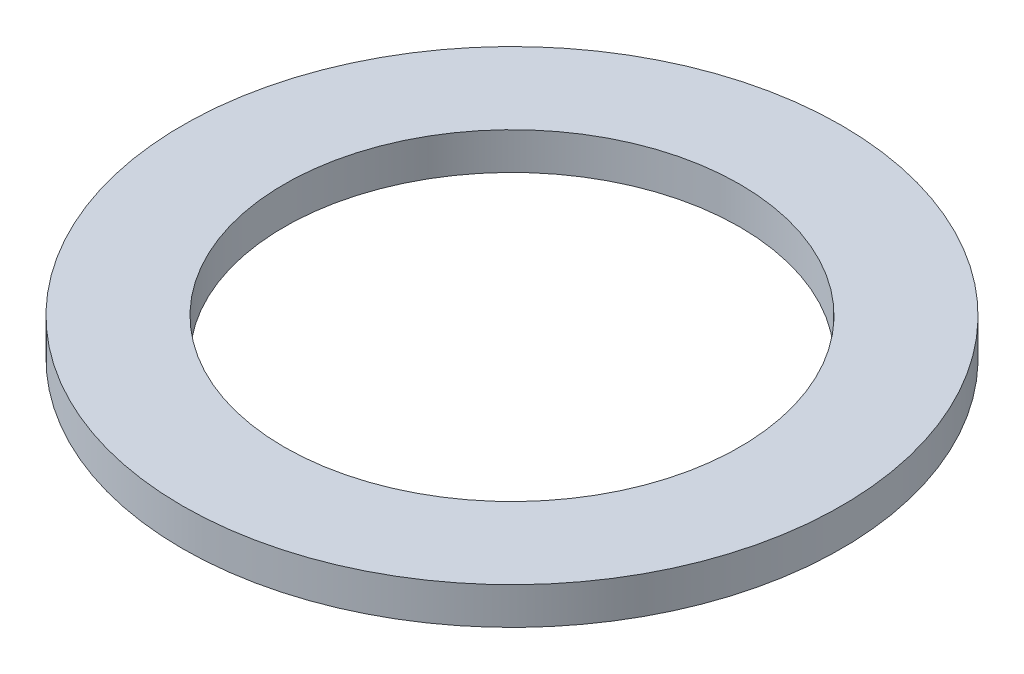
ISO-10303-21;
HEADER;
FILE_DESCRIPTION(('STEP AP214'),'2;1');
FILE_NAME('part.step','',(''),(''),'','','');
FILE_SCHEMA(('AUTOMOTIVE_DESIGN { 1 0 10303 214 1 1 1 1 }'));
ENDSEC;
DATA;
#1=APPLICATION_CONTEXT('core data for automotive mechanical design processes');
#2=APPLICATION_PROTOCOL_DEFINITION('international standard','automotive_design',2000,#1);
#3=PRODUCT_CONTEXT('',#1,'mechanical');
#4=PRODUCT('Part','Part','',(#3));
#5=PRODUCT_RELATED_PRODUCT_CATEGORY('part','',(#4));
#6=PRODUCT_DEFINITION_FORMATION('','',#4);
#7=PRODUCT_DEFINITION_CONTEXT('part definition',#1,'design');
#8=PRODUCT_DEFINITION('design','',#6,#7);
#9=PRODUCT_DEFINITION_SHAPE('','',#8);
#10=(LENGTH_UNIT() NAMED_UNIT(*) SI_UNIT(.MILLI.,.METRE.));
#11=(NAMED_UNIT(*) PLANE_ANGLE_UNIT() SI_UNIT($,.RADIAN.));
#12=(NAMED_UNIT(*) SI_UNIT($,.STERADIAN.) SOLID_ANGLE_UNIT());
#13=UNCERTAINTY_MEASURE_WITH_UNIT(LENGTH_MEASURE(1.E-05),#10,'distance_accuracy_value','');
#14=(GEOMETRIC_REPRESENTATION_CONTEXT(3) GLOBAL_UNCERTAINTY_ASSIGNED_CONTEXT((#13)) GLOBAL_UNIT_ASSIGNED_CONTEXT((#10,
#11,#12)) REPRESENTATION_CONTEXT('',''));
#15=CARTESIAN_POINT('',(0.,0.,0.));
#16=DIRECTION('',(0.,0.,1.));
#17=DIRECTION('',(1.,0.,0.));
#18=AXIS2_PLACEMENT_3D('',#15,#16,#17);
#19=CARTESIAN_POINT('',(0.,0.254,0.));
#20=DIRECTION('',(0.,-1.,0.));
#21=DIRECTION('',(0.,0.,-1.));
#22=AXIS2_PLACEMENT_3D('',#19,#20,#21);
#23=CYLINDRICAL_SURFACE('',#22,2.2606);
#24=CARTESIAN_POINT('',(0.,0.254,0.));
#25=DIRECTION('',(0.,1.,0.));
#26=DIRECTION('',(0.,0.,1.));
#27=AXIS2_PLACEMENT_3D('',#24,#25,#26);
#28=CIRCLE('',#27,2.2606);
#29=CARTESIAN_POINT('',(0.,0.254,2.2606));
#30=VERTEX_POINT('',#29);
#31=EDGE_CURVE('E10',#30,#30,#28,.T.);
#32=ORIENTED_EDGE('',*,*,#31,.F.);
#33=EDGE_LOOP('',(#32));
#34=FACE_BOUND('',#33,.T.);
#35=CARTESIAN_POINT('',(0.,0.,0.));
#36=DIRECTION('',(0.,1.,0.));
#37=DIRECTION('',(0.,0.,1.));
#38=AXIS2_PLACEMENT_3D('',#35,#36,#37);
#39=CIRCLE('',#38,2.2606);
#40=CARTESIAN_POINT('',(0.,0.,2.2606));
#41=VERTEX_POINT('',#40);
#42=EDGE_CURVE('E38',#41,#41,#39,.T.);
#43=ORIENTED_EDGE('',*,*,#42,.T.);
#44=EDGE_LOOP('',(#43));
#45=FACE_BOUND('',#44,.T.);
#46=ADVANCED_FACE('F35',(#34,#45),#23,.T.);
#47=CARTESIAN_POINT('',(0.,0.254,0.));
#48=DIRECTION('',(0.,1.,0.));
#49=DIRECTION('',(0.,0.,1.));
#50=AXIS2_PLACEMENT_3D('',#47,#48,#49);
#51=PLANE('',#50);
#52=CARTESIAN_POINT('',(0.,0.254,0.));
#53=DIRECTION('',(0.,1.,0.));
#54=DIRECTION('',(0.,0.,1.));
#55=AXIS2_PLACEMENT_3D('',#52,#53,#54);
#56=CIRCLE('',#55,1.5621);
#57=CARTESIAN_POINT('',(0.,0.254,1.5621));
#58=VERTEX_POINT('',#57);
#59=EDGE_CURVE('E47',#58,#58,#56,.T.);
#60=ORIENTED_EDGE('',*,*,#59,.F.);
#61=EDGE_LOOP('',(#60));
#62=FACE_BOUND('',#61,.T.);
#63=ORIENTED_EDGE('',*,*,#31,.T.);
#64=EDGE_LOOP('',(#63));
#65=FACE_BOUND('',#64,.T.);
#66=ADVANCED_FACE('F62',(#62,#65),#51,.T.);
#67=CARTESIAN_POINT('',(0.,0.,0.));
#68=DIRECTION('',(0.,1.,0.));
#69=DIRECTION('',(0.,0.,1.));
#70=AXIS2_PLACEMENT_3D('',#67,#68,#69);
#71=PLANE('',#70);
#72=CARTESIAN_POINT('',(0.,0.,0.));
#73=DIRECTION('',(0.,1.,0.));
#74=DIRECTION('',(0.,0.,1.));
#75=AXIS2_PLACEMENT_3D('',#72,#73,#74);
#76=CIRCLE('',#75,1.5621);
#77=CARTESIAN_POINT('',(0.,0.,1.5621));
#78=VERTEX_POINT('',#77);
#79=EDGE_CURVE('E45',#78,#78,#76,.T.);
#80=ORIENTED_EDGE('',*,*,#79,.T.);
#81=EDGE_LOOP('',(#80));
#82=FACE_BOUND('',#81,.T.);
#83=ORIENTED_EDGE('',*,*,#42,.F.);
#84=EDGE_LOOP('',(#83));
#85=FACE_BOUND('',#84,.T.);
#86=ADVANCED_FACE('F53',(#82,#85),#71,.F.);
#87=CARTESIAN_POINT('',(0.,0.,0.));
#88=DIRECTION('',(0.,1.,0.));
#89=DIRECTION('',(0.,0.,1.));
#90=AXIS2_PLACEMENT_3D('',#87,#88,#89);
#91=CYLINDRICAL_SURFACE('',#90,1.5621);
#92=ORIENTED_EDGE('',*,*,#79,.F.);
#93=EDGE_LOOP('',(#92));
#94=FACE_BOUND('',#93,.T.);
#95=ORIENTED_EDGE('',*,*,#59,.T.);
#96=EDGE_LOOP('',(#95));
#97=FACE_BOUND('',#96,.T.);
#98=ADVANCED_FACE('F56',(#94,#97),#91,.F.);
#99=CLOSED_SHELL('',(#46,#66,#86,#98));
#100=MANIFOLD_SOLID_BREP('B2',#99);
#101=ADVANCED_BREP_SHAPE_REPRESENTATION('',(#18,#100),#14);
#102=SHAPE_DEFINITION_REPRESENTATION(#9,#101);
ENDSEC;
END-ISO-10303-21;
